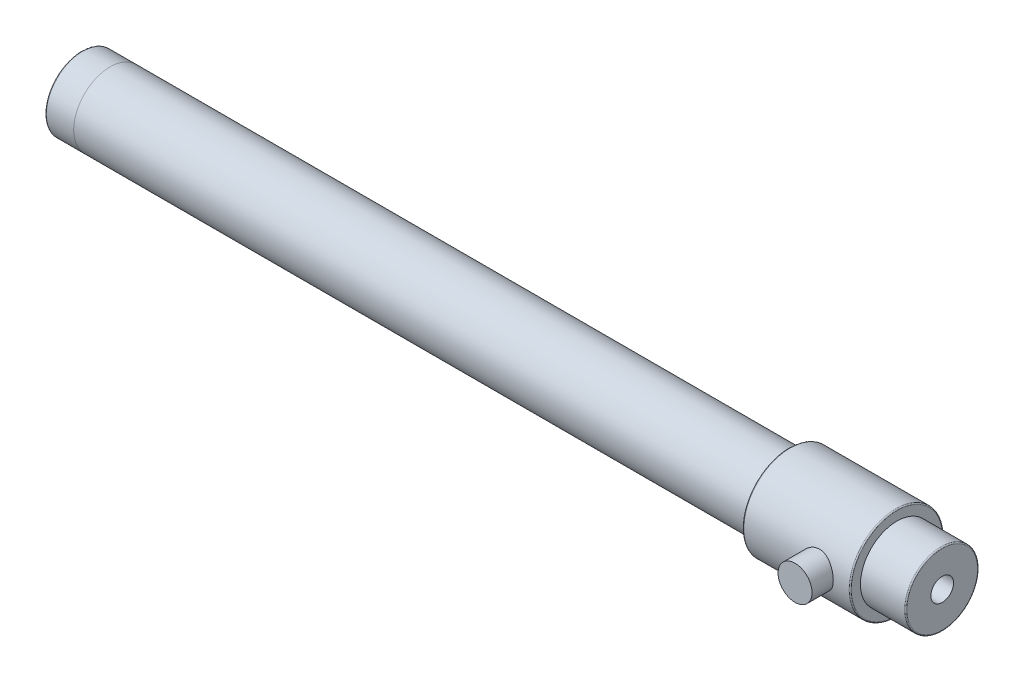
ISO-10303-21;
HEADER;
FILE_DESCRIPTION(('STEP AP214'),'2;1');
FILE_NAME('part.step','',(''),(''),'','','');
FILE_SCHEMA(('AUTOMOTIVE_DESIGN { 1 0 10303 214 1 1 1 1 }'));
ENDSEC;
DATA;
#1=APPLICATION_CONTEXT('core data for automotive mechanical design processes');
#2=APPLICATION_PROTOCOL_DEFINITION('international standard','automotive_design',2000,#1);
#3=PRODUCT_CONTEXT('',#1,'mechanical');
#4=PRODUCT('Part','Part','',(#3));
#5=PRODUCT_RELATED_PRODUCT_CATEGORY('part','',(#4));
#6=PRODUCT_DEFINITION_FORMATION('','',#4);
#7=PRODUCT_DEFINITION_CONTEXT('part definition',#1,'design');
#8=PRODUCT_DEFINITION('design','',#6,#7);
#9=PRODUCT_DEFINITION_SHAPE('','',#8);
#10=(LENGTH_UNIT() NAMED_UNIT(*) SI_UNIT(.MILLI.,.METRE.));
#11=(NAMED_UNIT(*) PLANE_ANGLE_UNIT() SI_UNIT($,.RADIAN.));
#12=(NAMED_UNIT(*) SI_UNIT($,.STERADIAN.) SOLID_ANGLE_UNIT());
#13=UNCERTAINTY_MEASURE_WITH_UNIT(LENGTH_MEASURE(1.E-05),#10,'distance_accuracy_value','');
#14=(GEOMETRIC_REPRESENTATION_CONTEXT(3) GLOBAL_UNCERTAINTY_ASSIGNED_CONTEXT((#13)) GLOBAL_UNIT_ASSIGNED_CONTEXT((#10,
#11,#12)) REPRESENTATION_CONTEXT('',''));
#15=CARTESIAN_POINT('',(0.,0.,0.));
#16=DIRECTION('',(0.,0.,1.));
#17=DIRECTION('',(1.,0.,0.));
#18=AXIS2_PLACEMENT_3D('',#15,#16,#17);
#19=CARTESIAN_POINT('',(0.,0.,0.));
#20=DIRECTION('',(-1.,0.,0.));
#21=DIRECTION('',(0.,0.,1.));
#22=AXIS2_PLACEMENT_3D('',#19,#20,#21);
#23=CYLINDRICAL_SURFACE('',#22,6.45);
#24=CARTESIAN_POINT('',(0.2,0.,0.));
#25=DIRECTION('',(1.,0.,0.));
#26=DIRECTION('',(0.,0.,-1.));
#27=AXIS2_PLACEMENT_3D('',#24,#25,#26);
#28=CIRCLE('',#27,6.45);
#29=CARTESIAN_POINT('',(0.2,0.,-6.45));
#30=VERTEX_POINT('',#29);
#31=EDGE_CURVE('E63',#30,#30,#28,.T.);
#32=ORIENTED_EDGE('',*,*,#31,.T.);
#33=EDGE_LOOP('',(#32));
#34=FACE_BOUND('',#33,.T.);
#35=CARTESIAN_POINT('',(5.,0.,0.));
#36=DIRECTION('',(-1.,0.,0.));
#37=DIRECTION('',(0.,0.,1.));
#38=AXIS2_PLACEMENT_3D('',#35,#36,#37);
#39=CIRCLE('',#38,6.45);
#40=CARTESIAN_POINT('',(5.,0.,6.45));
#41=VERTEX_POINT('',#40);
#42=EDGE_CURVE('E69',#41,#41,#39,.T.);
#43=ORIENTED_EDGE('',*,*,#42,.T.);
#44=EDGE_LOOP('',(#43));
#45=FACE_BOUND('',#44,.T.);
#46=ADVANCED_FACE('F37',(#34,#45),#23,.T.);
#47=CARTESIAN_POINT('',(0.,2.,0.));
#48=DIRECTION('',(1.,0.,0.));
#49=DIRECTION('',(0.,0.,-1.));
#50=AXIS2_PLACEMENT_3D('',#47,#48,#49);
#51=PLANE('',#50);
#52=CARTESIAN_POINT('',(0.,0.,0.));
#53=DIRECTION('',(1.,0.,0.));
#54=DIRECTION('',(0.,0.,-1.));
#55=AXIS2_PLACEMENT_3D('',#52,#53,#54);
#56=CIRCLE('',#55,6.25);
#57=CARTESIAN_POINT('',(0.,0.,-6.25));
#58=VERTEX_POINT('',#57);
#59=EDGE_CURVE('E66',#58,#58,#56,.F.);
#60=ORIENTED_EDGE('',*,*,#59,.T.);
#61=EDGE_LOOP('',(#60));
#62=FACE_BOUND('',#61,.T.);
#63=CARTESIAN_POINT('',(0.,0.,0.));
#64=DIRECTION('',(-1.,0.,0.));
#65=DIRECTION('',(0.,0.,1.));
#66=AXIS2_PLACEMENT_3D('',#63,#64,#65);
#67=CIRCLE('',#66,2.);
#68=CARTESIAN_POINT('',(0.,0.,2.));
#69=VERTEX_POINT('',#68);
#70=EDGE_CURVE('E81',#69,#69,#67,.T.);
#71=ORIENTED_EDGE('',*,*,#70,.F.);
#72=EDGE_LOOP('',(#71));
#73=FACE_BOUND('',#72,.T.);
#74=ADVANCED_FACE('F125',(#62,#73),#51,.F.);
#75=ORIENTED_EDGE('',*,*,#42,.F.);
#76=EDGE_LOOP('',(#75));
#77=FACE_BOUND('',#76,.T.);
#78=CARTESIAN_POINT('',(125.,0.,0.));
#79=DIRECTION('',(-1.,0.,0.));
#80=DIRECTION('',(0.,0.,1.));
#81=AXIS2_PLACEMENT_3D('',#78,#79,#80);
#82=CIRCLE('',#81,6.45);
#83=CARTESIAN_POINT('',(125.,0.,6.45));
#84=VERTEX_POINT('',#83);
#85=EDGE_CURVE('E72',#84,#84,#82,.T.);
#86=ORIENTED_EDGE('',*,*,#85,.T.);
#87=EDGE_LOOP('',(#86));
#88=FACE_BOUND('',#87,.T.);
#89=ADVANCED_FACE('F128',(#77,#88),#23,.T.);
#90=CARTESIAN_POINT('',(125.,6.45,0.));
#91=DIRECTION('',(1.,0.,0.));
#92=DIRECTION('',(0.,0.,-1.));
#93=AXIS2_PLACEMENT_3D('',#90,#91,#92);
#94=PLANE('',#93);
#95=CARTESIAN_POINT('',(125.,0.,0.));
#96=DIRECTION('',(1.,0.,0.));
#97=DIRECTION('',(0.,0.,-1.));
#98=AXIS2_PLACEMENT_3D('',#95,#96,#97);
#99=CIRCLE('',#98,8.05);
#100=CARTESIAN_POINT('',(125.,0.,-8.05));
#101=VERTEX_POINT('',#100);
#102=EDGE_CURVE('E11',#101,#101,#99,.F.);
#103=ORIENTED_EDGE('',*,*,#102,.T.);
#104=EDGE_LOOP('',(#103));
#105=FACE_BOUND('',#104,.T.);
#106=ORIENTED_EDGE('',*,*,#85,.F.);
#107=EDGE_LOOP('',(#106));
#108=FACE_BOUND('',#107,.T.);
#109=ADVANCED_FACE('F121',(#105,#108),#94,.F.);
#110=CARTESIAN_POINT('',(0.,0.,0.));
#111=DIRECTION('',(-1.,0.,0.));
#112=DIRECTION('',(0.,0.,1.));
#113=AXIS2_PLACEMENT_3D('',#110,#111,#112);
#114=CYLINDRICAL_SURFACE('',#113,8.25);
#115=CARTESIAN_POINT('',(141.,0.,8.25));
#116=CARTESIAN_POINT('',(141.000004219389,-0.162814750837352,8.25000308485776));
#117=CARTESIAN_POINT('',(140.986703707881,-0.32559980406924,8.24513757273671));
#118=CARTESIAN_POINT('',(140.934053317248,-0.646324189984892,8.22621221262225));
#119=CARTESIAN_POINT('',(140.894705439696,-0.804263894026999,8.21215307110135));
#120=CARTESIAN_POINT('',(140.79152293223,-1.11062694819667,8.17635488510918));
#121=CARTESIAN_POINT('',(140.727733787538,-1.25906738118256,8.15463011228978));
#122=CARTESIAN_POINT('',(140.577703577829,-1.5431343192919,8.10567940650091));
#123=CARTESIAN_POINT('',(140.491456891995,-1.67875760485884,8.07845209670372));
#124=CARTESIAN_POINT('',(140.295324025222,-1.93880542486251,8.02009632754868));
#125=CARTESIAN_POINT('',(140.184692928431,-2.06264419179554,7.98886208395204));
#126=CARTESIAN_POINT('',(139.944513376801,-2.29047598742248,7.92655009171983));
#127=CARTESIAN_POINT('',(139.814959640396,-2.39446345659228,7.89547238929054));
#128=CARTESIAN_POINT('',(139.535017425735,-2.58325561447547,7.83578078397285));
#129=CARTESIAN_POINT('',(139.384054091717,-2.66725169914625,7.8072929080021));
#130=CARTESIAN_POINT('',(139.068942785956,-2.80840409160115,7.75764183860898));
#131=CARTESIAN_POINT('',(138.904799750093,-2.8655703929102,7.73647591868695));
#132=CARTESIAN_POINT('',(138.574712014877,-2.9491601451819,7.70499131249367));
#133=CARTESIAN_POINT('',(138.409087596462,-2.97669625514618,7.69428155432546));
#134=CARTESIAN_POINT('',(138.075249366345,-3.00372327229996,7.68377366275813));
#135=CARTESIAN_POINT('',(137.907036568262,-3.00322489184895,7.68397136147107));
#136=CARTESIAN_POINT('',(137.582771696197,-2.97505151650776,7.69491727595116));
#137=CARTESIAN_POINT('',(137.426564392147,-2.94889281333553,7.70507682318806));
#138=CARTESIAN_POINT('',(137.120930307469,-2.87263863079154,7.73382766209438));
#139=CARTESIAN_POINT('',(136.97150448986,-2.82253976332213,7.75242014720438));
#140=CARTESIAN_POINT('',(136.680485456127,-2.69895072822328,7.79631430969933));
#141=CARTESIAN_POINT('',(136.539084089932,-2.62505175750753,7.82173184523417));
#142=CARTESIAN_POINT('',(136.270237872678,-2.4562446984385,7.87637078906301));
#143=CARTESIAN_POINT('',(136.142797652228,-2.36132967086132,7.905593452444));
#144=CARTESIAN_POINT('',(135.897060435743,-2.14615013915487,7.96679354934339));
#145=CARTESIAN_POINT('',(135.779842629196,-2.02466674234657,7.99882864564368));
#146=CARTESIAN_POINT('',(135.567133484258,-1.76338931739894,8.0604562476102));
#147=CARTESIAN_POINT('',(135.471645098151,-1.62359280519604,8.09004842101937));
#148=CARTESIAN_POINT('',(135.304009256263,-1.3270372237172,8.14398329541411));
#149=CARTESIAN_POINT('',(135.232201165591,-1.17007116063597,8.16824813404285));
#150=CARTESIAN_POINT('',(135.116362286075,-0.845186878684475,8.20822081040163));
#151=CARTESIAN_POINT('',(135.072319926661,-0.677273254126003,8.22393221215712));
#152=CARTESIAN_POINT('',(135.015290980389,-0.344358251029036,8.24441143445303));
#153=CARTESIAN_POINT('',(135.000849803261,-0.179637283402677,8.24969134298302));
#154=CARTESIAN_POINT('',(134.999223697232,0.149938700344227,8.25028192978131));
#155=CARTESIAN_POINT('',(135.012033148578,0.314793681819337,8.24559466352763));
#156=CARTESIAN_POINT('',(135.063425109624,0.63380439109633,8.2271158835393));
#157=CARTESIAN_POINT('',(135.101071836989,0.788132001882121,8.21365513847471));
#158=CARTESIAN_POINT('',(135.199855284248,1.08818575514414,8.17931383247003));
#159=CARTESIAN_POINT('',(135.260995059338,1.23391077603681,8.15843230650808));
#160=CARTESIAN_POINT('',(135.406943335111,1.51729616458818,8.11058357625118));
#161=CARTESIAN_POINT('',(135.492380024602,1.65460565003795,8.08345909311679));
#162=CARTESIAN_POINT('',(135.683779649801,1.91338601558489,8.0261478386249));
#163=CARTESIAN_POINT('',(135.789749827864,2.0348512819108,7.9959599885838));
#164=CARTESIAN_POINT('',(136.026011682225,2.26540732520824,7.93381770535252));
#165=CARTESIAN_POINT('',(136.157313837191,2.37346348188992,7.9018566248477));
#166=CARTESIAN_POINT('',(136.436836475179,2.56619115228633,7.84138993040256));
#167=CARTESIAN_POINT('',(136.585058016384,2.65086120223933,7.8128845328198));
#168=CARTESIAN_POINT('',(136.895059420851,2.79433777786615,7.76273128912141));
#169=CARTESIAN_POINT('',(137.056867197063,2.85308942593415,7.74109802035013));
#170=CARTESIAN_POINT('',(137.389076171837,2.94215932012075,7.70769131473648));
#171=CARTESIAN_POINT('',(137.559472423091,2.97249374283519,7.69591226875552));
#172=CARTESIAN_POINT('',(137.892886962239,3.00247051586581,7.68426342256029));
#173=CARTESIAN_POINT('',(138.055725551609,3.00386353481728,7.68371435332996));
#174=CARTESIAN_POINT('',(138.37918435013,2.98035348818062,7.69286350463998));
#175=CARTESIAN_POINT('',(138.53980474363,2.95545262131106,7.70256086836436));
#176=CARTESIAN_POINT('',(138.849892433602,2.88139238901422,7.73056076394429));
#177=CARTESIAN_POINT('',(138.999543688796,2.8329053044241,7.74862419043298));
#178=CARTESIAN_POINT('',(139.288684170135,2.71362633912175,7.79119520135933));
#179=CARTESIAN_POINT('',(139.428170893885,2.64282898855955,7.81570436586668));
#180=CARTESIAN_POINT('',(139.7006121813,2.47681721921669,7.86993360787975));
#181=CARTESIAN_POINT('',(139.832889594277,2.38055739627097,7.89985320383509));
#182=CARTESIAN_POINT('',(140.079975227518,2.16801258730415,7.9608060225778));
#183=CARTESIAN_POINT('',(140.194778047056,2.05172143394288,7.99183958600234));
#184=CARTESIAN_POINT('',(140.409449199434,1.79550554847259,8.05337409223132));
#185=CARTESIAN_POINT('',(140.508293249705,1.65469418104424,8.08377211876492));
#186=CARTESIAN_POINT('',(140.680855613358,1.3574037718078,8.13896704341452));
#187=CARTESIAN_POINT('',(140.754574474537,1.20092507168646,8.16376406364372));
#188=CARTESIAN_POINT('',(140.875364501809,0.873634225053934,8.20529855591795));
#189=CARTESIAN_POINT('',(140.921927105966,0.702613290739154,8.22188138853428));
#190=CARTESIAN_POINT('',(140.9842359684,0.354381394865291,8.24422811821897));
#191=CARTESIAN_POINT('',(140.99999540851,0.177173114165381,8.24999664309374));
#192=CARTESIAN_POINT('',(141.,0.,8.25));
#193=B_SPLINE_CURVE_WITH_KNOTS('',3,(#115,#116,#117,#118,#119,#120,#121,#122,#123,#124,#125,
#126,#127,#128,#129,#130,#131,#132,#133,#134,#135,#136,#137,#138,#139,#140,#141,#142,#143,#144,
#145,#146,#147,#148,#149,#150,#151,#152,#153,#154,#155,#156,#157,#158,#159,#160,#161,#162,#163,
#164,#165,#166,#167,#168,#169,#170,#171,#172,#173,#174,#175,#176,#177,#178,#179,#180,#181,#182,
#183,#184,#185,#186,#187,#188,#189,#190,#191,#192),.UNSPECIFIED.,.T.,.F.,(4,2,2,2,2,2,2,2,2,2,2,
2,2,2,2,2,2,2,2,2,2,2,2,2,2,2,2,2,2,2,2,2,2,2,2,2,2,2,4),(0.,0.487791156204651,
0.975544833135067,1.46239517447842,1.94936748516329,2.45402946245779,2.95883256793457,
3.48149088141082,4.00395436094788,4.50602908645632,5.00791196369787,5.4818213860964,
5.95579789772298,6.43839366560034,6.92114901846916,7.43426728424486,7.94745522362575,
8.46770688908369,8.98774161109176,9.48154208083423,9.97524072658025,10.4513261955327,
10.9274735988182,11.4172688760871,11.9072372242421,12.4238979124499,12.940590931685,
13.4583727664079,13.9758596727487,14.4619461073883,14.947991898258,15.4209306152926,
15.8939853739338,16.3907350179445,16.8876378778377,17.4092078566246,17.9307664630389,
18.4618024138281,18.9926110645347),.UNSPECIFIED.);
#194=CARTESIAN_POINT('',(141.,0.,8.25));
#195=VERTEX_POINT('',#194);
#196=EDGE_CURVE('E84',#195,#195,#193,.T.);
#197=ORIENTED_EDGE('',*,*,#196,.T.);
#198=EDGE_LOOP('',(#197));
#199=FACE_BOUND('',#198,.T.);
#200=CARTESIAN_POINT('',(143.8,0.,0.));
#201=DIRECTION('',(-1.,0.,0.));
#202=DIRECTION('',(0.,0.,1.));
#203=AXIS2_PLACEMENT_3D('',#200,#201,#202);
#204=CIRCLE('',#203,8.25);
#205=CARTESIAN_POINT('',(143.8,0.,8.25));
#206=VERTEX_POINT('',#205);
#207=EDGE_CURVE('E48',#206,#206,#204,.T.);
#208=ORIENTED_EDGE('',*,*,#207,.T.);
#209=EDGE_LOOP('',(#208));
#210=FACE_BOUND('',#209,.T.);
#211=CARTESIAN_POINT('',(125.2,0.,0.));
#212=DIRECTION('',(1.,0.,0.));
#213=DIRECTION('',(0.,0.,-1.));
#214=AXIS2_PLACEMENT_3D('',#211,#212,#213);
#215=CIRCLE('',#214,8.25);
#216=CARTESIAN_POINT('',(125.2,0.,-8.25));
#217=VERTEX_POINT('',#216);
#218=EDGE_CURVE('E52',#217,#217,#215,.T.);
#219=ORIENTED_EDGE('',*,*,#218,.T.);
#220=EDGE_LOOP('',(#219));
#221=FACE_BOUND('',#220,.T.);
#222=ADVANCED_FACE('F93',(#199,#210,#221),#114,.T.);
#223=CARTESIAN_POINT('',(144.,8.25,0.));
#224=DIRECTION('',(-1.,0.,0.));
#225=DIRECTION('',(0.,0.,1.));
#226=AXIS2_PLACEMENT_3D('',#223,#224,#225);
#227=PLANE('',#226);
#228=CARTESIAN_POINT('',(144.,0.,0.));
#229=DIRECTION('',(-1.,0.,0.));
#230=DIRECTION('',(0.,0.,1.));
#231=AXIS2_PLACEMENT_3D('',#228,#229,#230);
#232=CIRCLE('',#231,8.05);
#233=CARTESIAN_POINT('',(144.,0.,8.05));
#234=VERTEX_POINT('',#233);
#235=EDGE_CURVE('E44',#234,#234,#232,.F.);
#236=ORIENTED_EDGE('',*,*,#235,.T.);
#237=EDGE_LOOP('',(#236));
#238=FACE_BOUND('',#237,.T.);
#239=CARTESIAN_POINT('',(144.,0.,0.));
#240=DIRECTION('',(-1.,0.,0.));
#241=DIRECTION('',(0.,0.,1.));
#242=AXIS2_PLACEMENT_3D('',#239,#240,#241);
#243=CIRCLE('',#242,6.45);
#244=CARTESIAN_POINT('',(144.,0.,6.45));
#245=VERTEX_POINT('',#244);
#246=EDGE_CURVE('E75',#245,#245,#243,.T.);
#247=ORIENTED_EDGE('',*,*,#246,.T.);
#248=EDGE_LOOP('',(#247));
#249=FACE_BOUND('',#248,.T.);
#250=ADVANCED_FACE('F115',(#238,#249),#227,.F.);
#251=CARTESIAN_POINT('',(0.,0.,0.));
#252=DIRECTION('',(-1.,0.,0.));
#253=DIRECTION('',(0.,0.,1.));
#254=AXIS2_PLACEMENT_3D('',#251,#252,#253);
#255=CYLINDRICAL_SURFACE('',#254,6.45);
#256=CARTESIAN_POINT('',(151.8,0.,0.));
#257=DIRECTION('',(-1.,0.,0.));
#258=DIRECTION('',(0.,0.,1.));
#259=AXIS2_PLACEMENT_3D('',#256,#257,#258);
#260=CIRCLE('',#259,6.45);
#261=CARTESIAN_POINT('',(151.8,0.,6.45));
#262=VERTEX_POINT('',#261);
#263=EDGE_CURVE('E60',#262,#262,#260,.T.);
#264=ORIENTED_EDGE('',*,*,#263,.T.);
#265=EDGE_LOOP('',(#264));
#266=FACE_BOUND('',#265,.T.);
#267=ORIENTED_EDGE('',*,*,#246,.F.);
#268=EDGE_LOOP('',(#267));
#269=FACE_BOUND('',#268,.T.);
#270=ADVANCED_FACE('F112',(#266,#269),#255,.T.);
#271=CARTESIAN_POINT('',(152.,6.45,0.));
#272=DIRECTION('',(-1.,0.,0.));
#273=DIRECTION('',(0.,0.,1.));
#274=AXIS2_PLACEMENT_3D('',#271,#272,#273);
#275=PLANE('',#274);
#276=CARTESIAN_POINT('',(152.,0.,0.));
#277=DIRECTION('',(-1.,0.,0.));
#278=DIRECTION('',(0.,0.,1.));
#279=AXIS2_PLACEMENT_3D('',#276,#277,#278);
#280=CIRCLE('',#279,6.25);
#281=CARTESIAN_POINT('',(152.,0.,6.25));
#282=VERTEX_POINT('',#281);
#283=EDGE_CURVE('E57',#282,#282,#280,.F.);
#284=ORIENTED_EDGE('',*,*,#283,.T.);
#285=EDGE_LOOP('',(#284));
#286=FACE_BOUND('',#285,.T.);
#287=CARTESIAN_POINT('',(152.,0.,0.));
#288=DIRECTION('',(-1.,0.,0.));
#289=DIRECTION('',(0.,0.,1.));
#290=AXIS2_PLACEMENT_3D('',#287,#288,#289);
#291=CIRCLE('',#290,2.);
#292=CARTESIAN_POINT('',(152.,0.,2.));
#293=VERTEX_POINT('',#292);
#294=EDGE_CURVE('E78',#293,#293,#291,.T.);
#295=ORIENTED_EDGE('',*,*,#294,.T.);
#296=EDGE_LOOP('',(#295));
#297=FACE_BOUND('',#296,.T.);
#298=ADVANCED_FACE('F108',(#286,#297),#275,.F.);
#299=CARTESIAN_POINT('',(0.,0.,0.));
#300=DIRECTION('',(-1.,0.,0.));
#301=DIRECTION('',(0.,0.,1.));
#302=AXIS2_PLACEMENT_3D('',#299,#300,#301);
#303=CYLINDRICAL_SURFACE('',#302,2.);
#304=ORIENTED_EDGE('',*,*,#294,.F.);
#305=EDGE_LOOP('',(#304));
#306=FACE_BOUND('',#305,.T.);
#307=ORIENTED_EDGE('',*,*,#70,.T.);
#308=EDGE_LOOP('',(#307));
#309=FACE_BOUND('',#308,.T.);
#310=ADVANCED_FACE('F104',(#306,#309),#303,.F.);
#311=CARTESIAN_POINT('',(0.2,0.,0.));
#312=DIRECTION('',(1.,0.,0.));
#313=DIRECTION('',(0.,0.,-1.));
#314=AXIS2_PLACEMENT_3D('',#311,#312,#313);
#315=TOROIDAL_SURFACE('',#314,6.25,0.2);
#316=ORIENTED_EDGE('',*,*,#31,.F.);
#317=EDGE_LOOP('',(#316));
#318=FACE_BOUND('',#317,.T.);
#319=ORIENTED_EDGE('',*,*,#59,.F.);
#320=EDGE_LOOP('',(#319));
#321=FACE_BOUND('',#320,.T.);
#322=ADVANCED_FACE('F107',(#318,#321),#315,.T.);
#323=CARTESIAN_POINT('',(151.8,0.,0.));
#324=DIRECTION('',(-1.,0.,0.));
#325=DIRECTION('',(0.,0.,1.));
#326=AXIS2_PLACEMENT_3D('',#323,#324,#325);
#327=TOROIDAL_SURFACE('',#326,6.25,0.2);
#328=ORIENTED_EDGE('',*,*,#283,.F.);
#329=EDGE_LOOP('',(#328));
#330=FACE_BOUND('',#329,.T.);
#331=ORIENTED_EDGE('',*,*,#263,.F.);
#332=EDGE_LOOP('',(#331));
#333=FACE_BOUND('',#332,.T.);
#334=ADVANCED_FACE('F185',(#330,#333),#327,.T.);
#335=CARTESIAN_POINT('',(143.8,0.,0.));
#336=DIRECTION('',(-1.,0.,0.));
#337=DIRECTION('',(0.,0.,1.));
#338=AXIS2_PLACEMENT_3D('',#335,#336,#337);
#339=TOROIDAL_SURFACE('',#338,8.05,0.2);
#340=ORIENTED_EDGE('',*,*,#235,.F.);
#341=EDGE_LOOP('',(#340));
#342=FACE_BOUND('',#341,.T.);
#343=ORIENTED_EDGE('',*,*,#207,.F.);
#344=EDGE_LOOP('',(#343));
#345=FACE_BOUND('',#344,.T.);
#346=ADVANCED_FACE('F179',(#342,#345),#339,.T.);
#347=CARTESIAN_POINT('',(125.2,0.,0.));
#348=DIRECTION('',(1.,0.,0.));
#349=DIRECTION('',(0.,0.,-1.));
#350=AXIS2_PLACEMENT_3D('',#347,#348,#349);
#351=TOROIDAL_SURFACE('',#350,8.05,0.2);
#352=ORIENTED_EDGE('',*,*,#218,.F.);
#353=EDGE_LOOP('',(#352));
#354=FACE_BOUND('',#353,.T.);
#355=ORIENTED_EDGE('',*,*,#102,.F.);
#356=EDGE_LOOP('',(#355));
#357=FACE_BOUND('',#356,.T.);
#358=ADVANCED_FACE('F39',(#354,#357),#351,.T.);
#359=CARTESIAN_POINT('',(138.,0.,12.));
#360=DIRECTION('',(0.,0.,-1.));
#361=DIRECTION('',(0.,1.,0.));
#362=AXIS2_PLACEMENT_3D('',#359,#360,#361);
#363=CYLINDRICAL_SURFACE('',#362,2.99999999999999);
#364=CARTESIAN_POINT('',(138.,0.,12.));
#365=DIRECTION('',(0.,0.,-1.));
#366=DIRECTION('',(0.,1.,0.));
#367=AXIS2_PLACEMENT_3D('',#364,#365,#366);
#368=CIRCLE('',#367,2.99999999999999);
#369=CARTESIAN_POINT('',(138.,3.,12.));
#370=VERTEX_POINT('',#369);
#371=EDGE_CURVE('E92',#370,#370,#368,.T.);
#372=ORIENTED_EDGE('',*,*,#371,.T.);
#373=EDGE_LOOP('',(#372));
#374=FACE_BOUND('',#373,.T.);
#375=ORIENTED_EDGE('',*,*,#196,.F.);
#376=EDGE_LOOP('',(#375));
#377=FACE_BOUND('',#376,.T.);
#378=ADVANCED_FACE('F97',(#374,#377),#363,.T.);
#379=CARTESIAN_POINT('',(138.,0.,12.));
#380=DIRECTION('',(0.,0.,-1.));
#381=DIRECTION('',(0.,1.,0.));
#382=AXIS2_PLACEMENT_3D('',#379,#380,#381);
#383=PLANE('',#382);
#384=ORIENTED_EDGE('',*,*,#371,.F.);
#385=EDGE_LOOP('',(#384));
#386=FACE_BOUND('',#385,.T.);
#387=ADVANCED_FACE('F102',(#386),#383,.F.);
#388=CLOSED_SHELL('',(#46,#74,#89,#109,#222,#250,#270,#298,#310,#322,#334,#346,#358,#378,#387));
#389=MANIFOLD_SOLID_BREP('B2',#388);
#390=ADVANCED_BREP_SHAPE_REPRESENTATION('',(#18,#389),#14);
#391=SHAPE_DEFINITION_REPRESENTATION(#9,#390);
ENDSEC;
END-ISO-10303-21;
